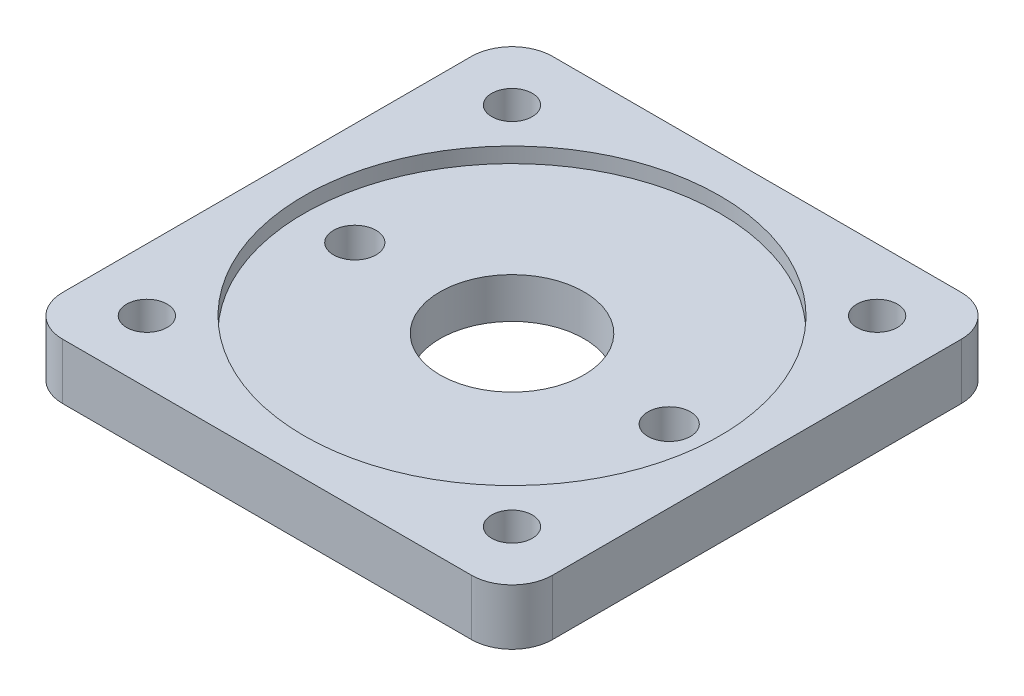
ISO-10303-21;
HEADER;
FILE_DESCRIPTION(('STEP AP214'),'2;1');
FILE_NAME('part.step','',(''),(''),'','','');
FILE_SCHEMA(('AUTOMOTIVE_DESIGN { 1 0 10303 214 1 1 1 1 }'));
ENDSEC;
DATA;
#1=APPLICATION_CONTEXT('core data for automotive mechanical design processes');
#2=APPLICATION_PROTOCOL_DEFINITION('international standard','automotive_design',2000,#1);
#3=PRODUCT_CONTEXT('',#1,'mechanical');
#4=PRODUCT('Part','Part','',(#3));
#5=PRODUCT_RELATED_PRODUCT_CATEGORY('part','',(#4));
#6=PRODUCT_DEFINITION_FORMATION('','',#4);
#7=PRODUCT_DEFINITION_CONTEXT('part definition',#1,'design');
#8=PRODUCT_DEFINITION('design','',#6,#7);
#9=PRODUCT_DEFINITION_SHAPE('','',#8);
#10=(LENGTH_UNIT() NAMED_UNIT(*) SI_UNIT(.MILLI.,.METRE.));
#11=(NAMED_UNIT(*) PLANE_ANGLE_UNIT() SI_UNIT($,.RADIAN.));
#12=(NAMED_UNIT(*) SI_UNIT($,.STERADIAN.) SOLID_ANGLE_UNIT());
#13=UNCERTAINTY_MEASURE_WITH_UNIT(LENGTH_MEASURE(1.E-05),#10,'distance_accuracy_value','');
#14=(GEOMETRIC_REPRESENTATION_CONTEXT(3) GLOBAL_UNCERTAINTY_ASSIGNED_CONTEXT((#13)) GLOBAL_UNIT_ASSIGNED_CONTEXT((#10,
#11,#12)) REPRESENTATION_CONTEXT('',''));
#15=CARTESIAN_POINT('',(0.,0.,0.));
#16=DIRECTION('',(0.,0.,1.));
#17=DIRECTION('',(1.,0.,0.));
#18=AXIS2_PLACEMENT_3D('',#15,#16,#17);
#19=CARTESIAN_POINT('',(0.,5.5,0.));
#20=DIRECTION('',(0.,-1.,0.));
#21=DIRECTION('',(0.,0.,-1.));
#22=AXIS2_PLACEMENT_3D('',#19,#20,#21);
#23=CYLINDRICAL_SURFACE('',#22,7.1);
#24=CARTESIAN_POINT('',(0.,0.,0.));
#25=DIRECTION('',(0.,1.,0.));
#26=DIRECTION('',(0.,0.,1.));
#27=AXIS2_PLACEMENT_3D('',#24,#25,#26);
#28=CIRCLE('',#27,7.1);
#29=CARTESIAN_POINT('',(0.,0.,7.1));
#30=VERTEX_POINT('',#29);
#31=EDGE_CURVE('E135',#30,#30,#28,.T.);
#32=ORIENTED_EDGE('',*,*,#31,.F.);
#33=EDGE_LOOP('',(#32));
#34=FACE_BOUND('',#33,.T.);
#35=CARTESIAN_POINT('',(0.,4.,0.));
#36=DIRECTION('',(0.,1.,0.));
#37=DIRECTION('',(0.,0.,1.));
#38=AXIS2_PLACEMENT_3D('',#35,#36,#37);
#39=CIRCLE('',#38,7.1);
#40=CARTESIAN_POINT('',(0.,4.,7.1));
#41=VERTEX_POINT('',#40);
#42=EDGE_CURVE('E213',#41,#41,#39,.T.);
#43=ORIENTED_EDGE('',*,*,#42,.T.);
#44=EDGE_LOOP('',(#43));
#45=FACE_BOUND('',#44,.T.);
#46=ADVANCED_FACE('F32',(#34,#45),#23,.F.);
#47=CARTESIAN_POINT('',(-15.5,5.5,0.));
#48=DIRECTION('',(0.,-1.,0.));
#49=DIRECTION('',(0.,0.,-1.));
#50=AXIS2_PLACEMENT_3D('',#47,#48,#49);
#51=CYLINDRICAL_SURFACE('',#50,2.1);
#52=CARTESIAN_POINT('',(-15.5,0.,0.));
#53=DIRECTION('',(0.,1.,0.));
#54=DIRECTION('',(0.,0.,1.));
#55=AXIS2_PLACEMENT_3D('',#52,#53,#54);
#56=CIRCLE('',#55,2.1);
#57=CARTESIAN_POINT('',(-15.5,0.,2.1));
#58=VERTEX_POINT('',#57);
#59=EDGE_CURVE('E205',#58,#58,#56,.T.);
#60=ORIENTED_EDGE('',*,*,#59,.F.);
#61=EDGE_LOOP('',(#60));
#62=FACE_BOUND('',#61,.T.);
#63=CARTESIAN_POINT('',(-15.5,4.,0.));
#64=DIRECTION('',(0.,1.,0.));
#65=DIRECTION('',(0.,0.,1.));
#66=AXIS2_PLACEMENT_3D('',#63,#64,#65);
#67=CIRCLE('',#66,2.1);
#68=CARTESIAN_POINT('',(-15.5,4.,2.1));
#69=VERTEX_POINT('',#68);
#70=EDGE_CURVE('E216',#69,#69,#67,.T.);
#71=ORIENTED_EDGE('',*,*,#70,.T.);
#72=EDGE_LOOP('',(#71));
#73=FACE_BOUND('',#72,.T.);
#74=ADVANCED_FACE('F245',(#62,#73),#51,.F.);
#75=CARTESIAN_POINT('',(15.5,5.5,0.));
#76=DIRECTION('',(0.,-1.,0.));
#77=DIRECTION('',(0.,0.,-1.));
#78=AXIS2_PLACEMENT_3D('',#75,#76,#77);
#79=CYLINDRICAL_SURFACE('',#78,2.1);
#80=CARTESIAN_POINT('',(15.5,0.,0.));
#81=DIRECTION('',(0.,1.,0.));
#82=DIRECTION('',(0.,0.,1.));
#83=AXIS2_PLACEMENT_3D('',#80,#81,#82);
#84=CIRCLE('',#83,2.1);
#85=CARTESIAN_POINT('',(15.5,0.,2.1));
#86=VERTEX_POINT('',#85);
#87=EDGE_CURVE('E210',#86,#86,#84,.T.);
#88=ORIENTED_EDGE('',*,*,#87,.F.);
#89=EDGE_LOOP('',(#88));
#90=FACE_BOUND('',#89,.T.);
#91=CARTESIAN_POINT('',(15.5,4.,0.));
#92=DIRECTION('',(0.,1.,0.));
#93=DIRECTION('',(0.,0.,1.));
#94=AXIS2_PLACEMENT_3D('',#91,#92,#93);
#95=CIRCLE('',#94,2.1);
#96=CARTESIAN_POINT('',(15.5,4.,2.1));
#97=VERTEX_POINT('',#96);
#98=EDGE_CURVE('E36',#97,#97,#95,.T.);
#99=ORIENTED_EDGE('',*,*,#98,.T.);
#100=EDGE_LOOP('',(#99));
#101=FACE_BOUND('',#100,.T.);
#102=ADVANCED_FACE('F229',(#90,#101),#79,.F.);
#103=CARTESIAN_POINT('',(-20.15,5.5,20.15));
#104=DIRECTION('',(0.,-1.,0.));
#105=DIRECTION('',(0.,0.,-1.));
#106=AXIS2_PLACEMENT_3D('',#103,#104,#105);
#107=PLANE('',#106);
#108=CARTESIAN_POINT('',(0.,5.5,0.));
#109=DIRECTION('',(0.,1.,0.));
#110=DIRECTION('',(0.,0.,1.));
#111=AXIS2_PLACEMENT_3D('',#108,#109,#110);
#112=CIRCLE('',#111,20.5);
#113=CARTESIAN_POINT('',(0.,5.5,20.5));
#114=VERTEX_POINT('',#113);
#115=EDGE_CURVE('E219',#114,#114,#112,.T.);
#116=ORIENTED_EDGE('',*,*,#115,.F.);
#117=EDGE_LOOP('',(#116));
#118=FACE_BOUND('',#117,.T.);
#119=CARTESIAN_POINT('',(-18.,5.5,18.));
#120=DIRECTION('',(0.,1.,0.));
#121=DIRECTION('',(0.,0.,1.));
#122=AXIS2_PLACEMENT_3D('',#119,#120,#121);
#123=CIRCLE('',#122,2.);
#124=CARTESIAN_POINT('',(-18.,5.5,20.));
#125=VERTEX_POINT('',#124);
#126=EDGE_CURVE('E193',#125,#125,#123,.T.);
#127=ORIENTED_EDGE('',*,*,#126,.F.);
#128=EDGE_LOOP('',(#127));
#129=FACE_BOUND('',#128,.T.);
#130=CARTESIAN_POINT('',(-18.,5.5,-18.));
#131=DIRECTION('',(0.,1.,0.));
#132=DIRECTION('',(0.,0.,1.));
#133=AXIS2_PLACEMENT_3D('',#130,#131,#132);
#134=CIRCLE('',#133,2.);
#135=CARTESIAN_POINT('',(-18.,5.5,-16.));
#136=VERTEX_POINT('',#135);
#137=EDGE_CURVE('E183',#136,#136,#134,.T.);
#138=ORIENTED_EDGE('',*,*,#137,.F.);
#139=EDGE_LOOP('',(#138));
#140=FACE_BOUND('',#139,.T.);
#141=CARTESIAN_POINT('',(-20.15,5.5,20.15));
#142=DIRECTION('',(0.,1.,0.));
#143=DIRECTION('',(0.,0.,-1.));
#144=AXIS2_PLACEMENT_3D('',#141,#142,#143);
#145=CIRCLE('',#144,4.);
#146=CARTESIAN_POINT('',(-24.15,5.5,20.15));
#147=VERTEX_POINT('',#146);
#148=CARTESIAN_POINT('',(-20.15,5.5,24.15));
#149=VERTEX_POINT('',#148);
#150=EDGE_CURVE('E146',#147,#149,#145,.T.);
#151=ORIENTED_EDGE('',*,*,#150,.T.);
#152=DIRECTION('',(1.,0.,0.));
#153=VECTOR('',#152,1.);
#154=CARTESIAN_POINT('',(-20.15,5.5,24.15));
#155=LINE('',#154,#153);
#156=CARTESIAN_POINT('',(20.15,5.5,24.15));
#157=VERTEX_POINT('',#156);
#158=EDGE_CURVE('E93',#149,#157,#155,.T.);
#159=ORIENTED_EDGE('',*,*,#158,.T.);
#160=CARTESIAN_POINT('',(20.15,5.5,20.15));
#161=DIRECTION('',(0.,1.,0.));
#162=DIRECTION('',(0.,0.,1.));
#163=AXIS2_PLACEMENT_3D('',#160,#161,#162);
#164=CIRCLE('',#163,4.);
#165=CARTESIAN_POINT('',(24.15,5.5,20.15));
#166=VERTEX_POINT('',#165);
#167=EDGE_CURVE('E162',#157,#166,#164,.T.);
#168=ORIENTED_EDGE('',*,*,#167,.T.);
#169=DIRECTION('',(0.,0.,-1.));
#170=VECTOR('',#169,1.);
#171=CARTESIAN_POINT('',(24.15,5.5,20.15));
#172=LINE('',#171,#170);
#173=CARTESIAN_POINT('',(24.15,5.5,-20.15));
#174=VERTEX_POINT('',#173);
#175=EDGE_CURVE('E175',#166,#174,#172,.T.);
#176=ORIENTED_EDGE('',*,*,#175,.T.);
#177=CARTESIAN_POINT('',(20.15,5.5,-20.15));
#178=DIRECTION('',(0.,1.,0.));
#179=DIRECTION('',(0.,0.,-1.));
#180=AXIS2_PLACEMENT_3D('',#177,#178,#179);
#181=CIRCLE('',#180,4.);
#182=CARTESIAN_POINT('',(20.15,5.5,-24.15));
#183=VERTEX_POINT('',#182);
#184=EDGE_CURVE('E113',#174,#183,#181,.T.);
#185=ORIENTED_EDGE('',*,*,#184,.T.);
#186=DIRECTION('',(-1.,0.,0.));
#187=VECTOR('',#186,1.);
#188=CARTESIAN_POINT('',(-20.15,5.5,-24.15));
#189=LINE('',#188,#187);
#190=CARTESIAN_POINT('',(-20.15,5.5,-24.15));
#191=VERTEX_POINT('',#190);
#192=EDGE_CURVE('E106',#183,#191,#189,.T.);
#193=ORIENTED_EDGE('',*,*,#192,.T.);
#194=CARTESIAN_POINT('',(-20.15,5.5,-20.15));
#195=DIRECTION('',(0.,1.,0.));
#196=DIRECTION('',(0.,0.,-1.));
#197=AXIS2_PLACEMENT_3D('',#194,#195,#196);
#198=CIRCLE('',#197,4.);
#199=CARTESIAN_POINT('',(-24.15,5.5,-20.15));
#200=VERTEX_POINT('',#199);
#201=EDGE_CURVE('E111',#191,#200,#198,.T.);
#202=ORIENTED_EDGE('',*,*,#201,.T.);
#203=DIRECTION('',(0.,0.,1.));
#204=VECTOR('',#203,1.);
#205=CARTESIAN_POINT('',(-24.15,5.5,20.15));
#206=LINE('',#205,#204);
#207=EDGE_CURVE('E50',#200,#147,#206,.T.);
#208=ORIENTED_EDGE('',*,*,#207,.T.);
#209=EDGE_LOOP('',(#151,#159,#168,#176,#185,#193,#202,#208));
#210=FACE_BOUND('',#209,.T.);
#211=CARTESIAN_POINT('',(18.,5.5,-18.));
#212=DIRECTION('',(0.,1.,0.));
#213=DIRECTION('',(0.,0.,1.));
#214=AXIS2_PLACEMENT_3D('',#211,#212,#213);
#215=CIRCLE('',#214,2.);
#216=CARTESIAN_POINT('',(18.,5.5,-16.));
#217=VERTEX_POINT('',#216);
#218=EDGE_CURVE('E187',#217,#217,#215,.T.);
#219=ORIENTED_EDGE('',*,*,#218,.F.);
#220=EDGE_LOOP('',(#219));
#221=FACE_BOUND('',#220,.T.);
#222=CARTESIAN_POINT('',(18.,5.5,18.));
#223=DIRECTION('',(0.,1.,0.));
#224=DIRECTION('',(0.,0.,1.));
#225=AXIS2_PLACEMENT_3D('',#222,#223,#224);
#226=CIRCLE('',#225,2.);
#227=CARTESIAN_POINT('',(18.,5.5,20.));
#228=VERTEX_POINT('',#227);
#229=EDGE_CURVE('E199',#228,#228,#226,.T.);
#230=ORIENTED_EDGE('',*,*,#229,.F.);
#231=EDGE_LOOP('',(#230));
#232=FACE_BOUND('',#231,.T.);
#233=ADVANCED_FACE('F108',(#118,#129,#140,#210,#221,#232),#107,.F.);
#234=CARTESIAN_POINT('',(-20.15,0.,20.15));
#235=DIRECTION('',(0.,-1.,0.));
#236=DIRECTION('',(0.,0.,-1.));
#237=AXIS2_PLACEMENT_3D('',#234,#235,#236);
#238=PLANE('',#237);
#239=ORIENTED_EDGE('',*,*,#59,.T.);
#240=EDGE_LOOP('',(#239));
#241=FACE_BOUND('',#240,.T.);
#242=CARTESIAN_POINT('',(-18.,0.,18.));
#243=DIRECTION('',(0.,1.,0.));
#244=DIRECTION('',(0.,0.,1.));
#245=AXIS2_PLACEMENT_3D('',#242,#243,#244);
#246=CIRCLE('',#245,2.);
#247=CARTESIAN_POINT('',(-18.,0.,20.));
#248=VERTEX_POINT('',#247);
#249=EDGE_CURVE('E196',#248,#248,#246,.T.);
#250=ORIENTED_EDGE('',*,*,#249,.T.);
#251=EDGE_LOOP('',(#250));
#252=FACE_BOUND('',#251,.T.);
#253=CARTESIAN_POINT('',(-18.,0.,-18.));
#254=DIRECTION('',(0.,1.,0.));
#255=DIRECTION('',(0.,0.,1.));
#256=AXIS2_PLACEMENT_3D('',#253,#254,#255);
#257=CIRCLE('',#256,2.);
#258=CARTESIAN_POINT('',(-18.,0.,-16.));
#259=VERTEX_POINT('',#258);
#260=EDGE_CURVE('E184',#259,#259,#257,.T.);
#261=ORIENTED_EDGE('',*,*,#260,.T.);
#262=EDGE_LOOP('',(#261));
#263=FACE_BOUND('',#262,.T.);
#264=CARTESIAN_POINT('',(-20.15,0.,20.15));
#265=DIRECTION('',(0.,1.,0.));
#266=DIRECTION('',(0.,0.,-1.));
#267=AXIS2_PLACEMENT_3D('',#264,#265,#266);
#268=CIRCLE('',#267,4.);
#269=CARTESIAN_POINT('',(-24.15,0.,20.15));
#270=VERTEX_POINT('',#269);
#271=CARTESIAN_POINT('',(-20.15,0.,24.15));
#272=VERTEX_POINT('',#271);
#273=EDGE_CURVE('E131',#270,#272,#268,.T.);
#274=ORIENTED_EDGE('',*,*,#273,.F.);
#275=DIRECTION('',(0.,0.,1.));
#276=VECTOR('',#275,1.);
#277=CARTESIAN_POINT('',(-24.15,0.,20.15));
#278=LINE('',#277,#276);
#279=CARTESIAN_POINT('',(-24.15,0.,-20.15));
#280=VERTEX_POINT('',#279);
#281=EDGE_CURVE('E85',#280,#270,#278,.T.);
#282=ORIENTED_EDGE('',*,*,#281,.F.);
#283=CARTESIAN_POINT('',(-20.15,0.,-20.15));
#284=DIRECTION('',(0.,1.,0.));
#285=DIRECTION('',(0.,0.,-1.));
#286=AXIS2_PLACEMENT_3D('',#283,#284,#285);
#287=CIRCLE('',#286,4.);
#288=CARTESIAN_POINT('',(-20.15,0.,-24.15));
#289=VERTEX_POINT('',#288);
#290=EDGE_CURVE('E79',#289,#280,#287,.T.);
#291=ORIENTED_EDGE('',*,*,#290,.F.);
#292=DIRECTION('',(-1.,0.,0.));
#293=VECTOR('',#292,1.);
#294=CARTESIAN_POINT('',(-20.15,0.,-24.15));
#295=LINE('',#294,#293);
#296=CARTESIAN_POINT('',(20.15,0.,-24.15));
#297=VERTEX_POINT('',#296);
#298=EDGE_CURVE('E121',#297,#289,#295,.T.);
#299=ORIENTED_EDGE('',*,*,#298,.F.);
#300=CARTESIAN_POINT('',(20.15,0.,-20.15));
#301=DIRECTION('',(0.,1.,0.));
#302=DIRECTION('',(0.,0.,-1.));
#303=AXIS2_PLACEMENT_3D('',#300,#301,#302);
#304=CIRCLE('',#303,4.);
#305=CARTESIAN_POINT('',(24.15,0.,-20.15));
#306=VERTEX_POINT('',#305);
#307=EDGE_CURVE('E141',#306,#297,#304,.T.);
#308=ORIENTED_EDGE('',*,*,#307,.F.);
#309=DIRECTION('',(0.,0.,-1.));
#310=VECTOR('',#309,1.);
#311=CARTESIAN_POINT('',(24.15,0.,20.15));
#312=LINE('',#311,#310);
#313=CARTESIAN_POINT('',(24.15,0.,20.15));
#314=VERTEX_POINT('',#313);
#315=EDGE_CURVE('E139',#314,#306,#312,.T.);
#316=ORIENTED_EDGE('',*,*,#315,.F.);
#317=CARTESIAN_POINT('',(20.15,0.,20.15));
#318=DIRECTION('',(0.,1.,0.));
#319=DIRECTION('',(0.,0.,1.));
#320=AXIS2_PLACEMENT_3D('',#317,#318,#319);
#321=CIRCLE('',#320,4.);
#322=CARTESIAN_POINT('',(20.15,0.,24.15));
#323=VERTEX_POINT('',#322);
#324=EDGE_CURVE('E137',#323,#314,#321,.T.);
#325=ORIENTED_EDGE('',*,*,#324,.F.);
#326=DIRECTION('',(1.,0.,0.));
#327=VECTOR('',#326,1.);
#328=CARTESIAN_POINT('',(-20.15,0.,24.15));
#329=LINE('',#328,#327);
#330=EDGE_CURVE('E134',#272,#323,#329,.T.);
#331=ORIENTED_EDGE('',*,*,#330,.F.);
#332=EDGE_LOOP('',(#274,#282,#291,#299,#308,#316,#325,#331));
#333=FACE_BOUND('',#332,.T.);
#334=ORIENTED_EDGE('',*,*,#31,.T.);
#335=EDGE_LOOP('',(#334));
#336=FACE_BOUND('',#335,.T.);
#337=CARTESIAN_POINT('',(18.,0.,-18.));
#338=DIRECTION('',(0.,1.,0.));
#339=DIRECTION('',(0.,0.,1.));
#340=AXIS2_PLACEMENT_3D('',#337,#338,#339);
#341=CIRCLE('',#340,2.);
#342=CARTESIAN_POINT('',(18.,0.,-16.));
#343=VERTEX_POINT('',#342);
#344=EDGE_CURVE('E190',#343,#343,#341,.T.);
#345=ORIENTED_EDGE('',*,*,#344,.T.);
#346=EDGE_LOOP('',(#345));
#347=FACE_BOUND('',#346,.T.);
#348=CARTESIAN_POINT('',(18.,0.,18.));
#349=DIRECTION('',(0.,1.,0.));
#350=DIRECTION('',(0.,0.,1.));
#351=AXIS2_PLACEMENT_3D('',#348,#349,#350);
#352=CIRCLE('',#351,2.);
#353=CARTESIAN_POINT('',(18.,0.,20.));
#354=VERTEX_POINT('',#353);
#355=EDGE_CURVE('E202',#354,#354,#352,.T.);
#356=ORIENTED_EDGE('',*,*,#355,.T.);
#357=EDGE_LOOP('',(#356));
#358=FACE_BOUND('',#357,.T.);
#359=ORIENTED_EDGE('',*,*,#87,.T.);
#360=EDGE_LOOP('',(#359));
#361=FACE_BOUND('',#360,.T.);
#362=ADVANCED_FACE('F166',(#241,#252,#263,#333,#336,#347,#358,#361),#238,.T.);
#363=CARTESIAN_POINT('',(-20.15,5.5,20.15));
#364=DIRECTION('',(0.,-1.,0.));
#365=DIRECTION('',(0.,0.,-1.));
#366=AXIS2_PLACEMENT_3D('',#363,#364,#365);
#367=CYLINDRICAL_SURFACE('',#366,4.);
#368=ORIENTED_EDGE('',*,*,#273,.T.);
#369=DIRECTION('',(0.,-1.,0.));
#370=VECTOR('',#369,1.);
#371=CARTESIAN_POINT('',(-20.15,5.5,24.15));
#372=LINE('',#371,#370);
#373=EDGE_CURVE('E11',#149,#272,#372,.T.);
#374=ORIENTED_EDGE('',*,*,#373,.F.);
#375=ORIENTED_EDGE('',*,*,#150,.F.);
#376=DIRECTION('',(0.,-1.,0.));
#377=VECTOR('',#376,1.);
#378=CARTESIAN_POINT('',(-24.15,5.5,20.15));
#379=LINE('',#378,#377);
#380=EDGE_CURVE('E127',#147,#270,#379,.T.);
#381=ORIENTED_EDGE('',*,*,#380,.T.);
#382=EDGE_LOOP('',(#368,#374,#375,#381));
#383=FACE_BOUND('',#382,.T.);
#384=ADVANCED_FACE('F34',(#383),#367,.T.);
#385=CARTESIAN_POINT('',(-20.15,5.5,24.15));
#386=DIRECTION('',(0.,0.,-1.));
#387=DIRECTION('',(-1.,0.,0.));
#388=AXIS2_PLACEMENT_3D('',#385,#386,#387);
#389=PLANE('',#388);
#390=ORIENTED_EDGE('',*,*,#330,.T.);
#391=DIRECTION('',(0.,-1.,0.));
#392=VECTOR('',#391,1.);
#393=CARTESIAN_POINT('',(20.15,5.5,24.15));
#394=LINE('',#393,#392);
#395=EDGE_CURVE('E42',#157,#323,#394,.T.);
#396=ORIENTED_EDGE('',*,*,#395,.F.);
#397=ORIENTED_EDGE('',*,*,#158,.F.);
#398=ORIENTED_EDGE('',*,*,#373,.T.);
#399=EDGE_LOOP('',(#390,#396,#397,#398));
#400=FACE_BOUND('',#399,.T.);
#401=ADVANCED_FACE('F277',(#400),#389,.F.);
#402=CARTESIAN_POINT('',(20.15,5.5,20.15));
#403=DIRECTION('',(0.,-1.,0.));
#404=DIRECTION('',(0.,0.,-1.));
#405=AXIS2_PLACEMENT_3D('',#402,#403,#404);
#406=CYLINDRICAL_SURFACE('',#405,4.);
#407=ORIENTED_EDGE('',*,*,#324,.T.);
#408=DIRECTION('',(0.,-1.,0.));
#409=VECTOR('',#408,1.);
#410=CARTESIAN_POINT('',(24.15,5.5,20.15));
#411=LINE('',#410,#409);
#412=EDGE_CURVE('E153',#166,#314,#411,.T.);
#413=ORIENTED_EDGE('',*,*,#412,.F.);
#414=ORIENTED_EDGE('',*,*,#167,.F.);
#415=ORIENTED_EDGE('',*,*,#395,.T.);
#416=EDGE_LOOP('',(#407,#413,#414,#415));
#417=FACE_BOUND('',#416,.T.);
#418=ADVANCED_FACE('F160',(#417),#406,.T.);
#419=CARTESIAN_POINT('',(24.15,5.5,20.15));
#420=DIRECTION('',(-1.,0.,0.));
#421=DIRECTION('',(0.,0.,1.));
#422=AXIS2_PLACEMENT_3D('',#419,#420,#421);
#423=PLANE('',#422);
#424=ORIENTED_EDGE('',*,*,#315,.T.);
#425=DIRECTION('',(0.,-1.,0.));
#426=VECTOR('',#425,1.);
#427=CARTESIAN_POINT('',(24.15,5.5,-20.15));
#428=LINE('',#427,#426);
#429=EDGE_CURVE('E150',#174,#306,#428,.T.);
#430=ORIENTED_EDGE('',*,*,#429,.F.);
#431=ORIENTED_EDGE('',*,*,#175,.F.);
#432=ORIENTED_EDGE('',*,*,#412,.T.);
#433=EDGE_LOOP('',(#424,#430,#431,#432));
#434=FACE_BOUND('',#433,.T.);
#435=ADVANCED_FACE('F171',(#434),#423,.F.);
#436=CARTESIAN_POINT('',(20.15,5.5,-20.15));
#437=DIRECTION('',(0.,-1.,0.));
#438=DIRECTION('',(0.,0.,-1.));
#439=AXIS2_PLACEMENT_3D('',#436,#437,#438);
#440=CYLINDRICAL_SURFACE('',#439,4.);
#441=ORIENTED_EDGE('',*,*,#307,.T.);
#442=DIRECTION('',(0.,-1.,0.));
#443=VECTOR('',#442,1.);
#444=CARTESIAN_POINT('',(20.15,5.5,-24.15));
#445=LINE('',#444,#443);
#446=EDGE_CURVE('E122',#183,#297,#445,.T.);
#447=ORIENTED_EDGE('',*,*,#446,.F.);
#448=ORIENTED_EDGE('',*,*,#184,.F.);
#449=ORIENTED_EDGE('',*,*,#429,.T.);
#450=EDGE_LOOP('',(#441,#447,#448,#449));
#451=FACE_BOUND('',#450,.T.);
#452=ADVANCED_FACE('F174',(#451),#440,.T.);
#453=CARTESIAN_POINT('',(-20.15,5.5,-24.15));
#454=DIRECTION('',(0.,0.,1.));
#455=DIRECTION('',(1.,0.,0.));
#456=AXIS2_PLACEMENT_3D('',#453,#454,#455);
#457=PLANE('',#456);
#458=ORIENTED_EDGE('',*,*,#298,.T.);
#459=DIRECTION('',(0.,-1.,0.));
#460=VECTOR('',#459,1.);
#461=CARTESIAN_POINT('',(-20.15,5.5,-24.15));
#462=LINE('',#461,#460);
#463=EDGE_CURVE('E118',#191,#289,#462,.T.);
#464=ORIENTED_EDGE('',*,*,#463,.F.);
#465=ORIENTED_EDGE('',*,*,#192,.F.);
#466=ORIENTED_EDGE('',*,*,#446,.T.);
#467=EDGE_LOOP('',(#458,#464,#465,#466));
#468=FACE_BOUND('',#467,.T.);
#469=ADVANCED_FACE('F119',(#468),#457,.F.);
#470=CARTESIAN_POINT('',(-20.15,5.5,-20.15));
#471=DIRECTION('',(0.,-1.,0.));
#472=DIRECTION('',(0.,0.,-1.));
#473=AXIS2_PLACEMENT_3D('',#470,#471,#472);
#474=CYLINDRICAL_SURFACE('',#473,4.);
#475=ORIENTED_EDGE('',*,*,#290,.T.);
#476=DIRECTION('',(0.,-1.,0.));
#477=VECTOR('',#476,1.);
#478=CARTESIAN_POINT('',(-24.15,5.5,-20.15));
#479=LINE('',#478,#477);
#480=EDGE_CURVE('E123',#200,#280,#479,.T.);
#481=ORIENTED_EDGE('',*,*,#480,.F.);
#482=ORIENTED_EDGE('',*,*,#201,.F.);
#483=ORIENTED_EDGE('',*,*,#463,.T.);
#484=EDGE_LOOP('',(#475,#481,#482,#483));
#485=FACE_BOUND('',#484,.T.);
#486=ADVANCED_FACE('F125',(#485),#474,.T.);
#487=CARTESIAN_POINT('',(-24.15,5.5,20.15));
#488=DIRECTION('',(1.,0.,0.));
#489=DIRECTION('',(0.,0.,-1.));
#490=AXIS2_PLACEMENT_3D('',#487,#488,#489);
#491=PLANE('',#490);
#492=ORIENTED_EDGE('',*,*,#281,.T.);
#493=ORIENTED_EDGE('',*,*,#380,.F.);
#494=ORIENTED_EDGE('',*,*,#207,.F.);
#495=ORIENTED_EDGE('',*,*,#480,.T.);
#496=EDGE_LOOP('',(#492,#493,#494,#495));
#497=FACE_BOUND('',#496,.T.);
#498=ADVANCED_FACE('F265',(#497),#491,.F.);
#499=CARTESIAN_POINT('',(-18.,5.5,-18.));
#500=DIRECTION('',(0.,-1.,0.));
#501=DIRECTION('',(0.,0.,-1.));
#502=AXIS2_PLACEMENT_3D('',#499,#500,#501);
#503=CYLINDRICAL_SURFACE('',#502,2.);
#504=ORIENTED_EDGE('',*,*,#137,.T.);
#505=EDGE_LOOP('',(#504));
#506=FACE_BOUND('',#505,.T.);
#507=ORIENTED_EDGE('',*,*,#260,.F.);
#508=EDGE_LOOP('',(#507));
#509=FACE_BOUND('',#508,.T.);
#510=ADVANCED_FACE('F257',(#506,#509),#503,.F.);
#511=CARTESIAN_POINT('',(18.,5.5,-18.));
#512=DIRECTION('',(0.,-1.,0.));
#513=DIRECTION('',(0.,0.,-1.));
#514=AXIS2_PLACEMENT_3D('',#511,#512,#513);
#515=CYLINDRICAL_SURFACE('',#514,2.);
#516=ORIENTED_EDGE('',*,*,#218,.T.);
#517=EDGE_LOOP('',(#516));
#518=FACE_BOUND('',#517,.T.);
#519=ORIENTED_EDGE('',*,*,#344,.F.);
#520=EDGE_LOOP('',(#519));
#521=FACE_BOUND('',#520,.T.);
#522=ADVANCED_FACE('F331',(#518,#521),#515,.F.);
#523=CARTESIAN_POINT('',(-18.,5.5,18.));
#524=DIRECTION('',(0.,-1.,0.));
#525=DIRECTION('',(0.,0.,-1.));
#526=AXIS2_PLACEMENT_3D('',#523,#524,#525);
#527=CYLINDRICAL_SURFACE('',#526,2.);
#528=ORIENTED_EDGE('',*,*,#126,.T.);
#529=EDGE_LOOP('',(#528));
#530=FACE_BOUND('',#529,.T.);
#531=ORIENTED_EDGE('',*,*,#249,.F.);
#532=EDGE_LOOP('',(#531));
#533=FACE_BOUND('',#532,.T.);
#534=ADVANCED_FACE('F321',(#530,#533),#527,.F.);
#535=CARTESIAN_POINT('',(18.,5.5,18.));
#536=DIRECTION('',(0.,-1.,0.));
#537=DIRECTION('',(0.,0.,-1.));
#538=AXIS2_PLACEMENT_3D('',#535,#536,#537);
#539=CYLINDRICAL_SURFACE('',#538,2.);
#540=ORIENTED_EDGE('',*,*,#229,.T.);
#541=EDGE_LOOP('',(#540));
#542=FACE_BOUND('',#541,.T.);
#543=ORIENTED_EDGE('',*,*,#355,.F.);
#544=EDGE_LOOP('',(#543));
#545=FACE_BOUND('',#544,.T.);
#546=ADVANCED_FACE('F239',(#542,#545),#539,.F.);
#547=CARTESIAN_POINT('',(0.,4.,0.));
#548=DIRECTION('',(0.,1.,0.));
#549=DIRECTION('',(0.,0.,1.));
#550=AXIS2_PLACEMENT_3D('',#547,#548,#549);
#551=CYLINDRICAL_SURFACE('',#550,20.5);
#552=CARTESIAN_POINT('',(0.,4.,0.));
#553=DIRECTION('',(0.,1.,0.));
#554=DIRECTION('',(0.,0.,1.));
#555=AXIS2_PLACEMENT_3D('',#552,#553,#554);
#556=CIRCLE('',#555,20.5);
#557=CARTESIAN_POINT('',(0.,4.,20.5));
#558=VERTEX_POINT('',#557);
#559=EDGE_CURVE('E222',#558,#558,#556,.T.);
#560=ORIENTED_EDGE('',*,*,#559,.F.);
#561=EDGE_LOOP('',(#560));
#562=FACE_BOUND('',#561,.T.);
#563=ORIENTED_EDGE('',*,*,#115,.T.);
#564=EDGE_LOOP('',(#563));
#565=FACE_BOUND('',#564,.T.);
#566=ADVANCED_FACE('F233',(#562,#565),#551,.F.);
#567=CARTESIAN_POINT('',(0.,4.,0.));
#568=DIRECTION('',(0.,1.,0.));
#569=DIRECTION('',(0.,0.,1.));
#570=AXIS2_PLACEMENT_3D('',#567,#568,#569);
#571=PLANE('',#570);
#572=ORIENTED_EDGE('',*,*,#42,.F.);
#573=EDGE_LOOP('',(#572));
#574=FACE_BOUND('',#573,.T.);
#575=ORIENTED_EDGE('',*,*,#70,.F.);
#576=EDGE_LOOP('',(#575));
#577=FACE_BOUND('',#576,.T.);
#578=ORIENTED_EDGE('',*,*,#98,.F.);
#579=EDGE_LOOP('',(#578));
#580=FACE_BOUND('',#579,.T.);
#581=ORIENTED_EDGE('',*,*,#559,.T.);
#582=EDGE_LOOP('',(#581));
#583=FACE_BOUND('',#582,.T.);
#584=ADVANCED_FACE('F231',(#574,#577,#580,#583),#571,.T.);
#585=CLOSED_SHELL('',(#46,#74,#102,#233,#362,#384,#401,#418,#435,#452,#469,#486,#498,#510,#522,
#534,#546,#566,#584));
#586=MANIFOLD_SOLID_BREP('B2',#585);
#587=ADVANCED_BREP_SHAPE_REPRESENTATION('',(#18,#586),#14);
#588=SHAPE_DEFINITION_REPRESENTATION(#9,#587);
ENDSEC;
END-ISO-10303-21;
